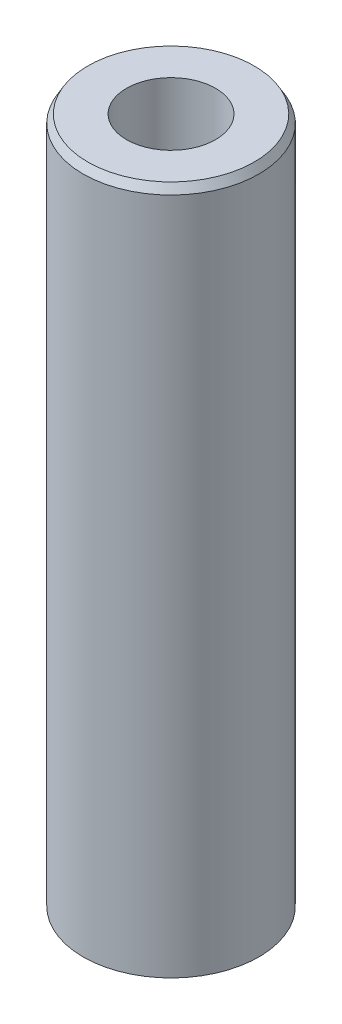
ISO-10303-21;
HEADER;
FILE_DESCRIPTION(('STEP AP214'),'2;1');
FILE_NAME('part.step','',(''),(''),'','','');
FILE_SCHEMA(('AUTOMOTIVE_DESIGN { 1 0 10303 214 1 1 1 1 }'));
ENDSEC;
DATA;
#1=APPLICATION_CONTEXT('core data for automotive mechanical design processes');
#2=APPLICATION_PROTOCOL_DEFINITION('international standard','automotive_design',2000,#1);
#3=PRODUCT_CONTEXT('',#1,'mechanical');
#4=PRODUCT('Part','Part','',(#3));
#5=PRODUCT_RELATED_PRODUCT_CATEGORY('part','',(#4));
#6=PRODUCT_DEFINITION_FORMATION('','',#4);
#7=PRODUCT_DEFINITION_CONTEXT('part definition',#1,'design');
#8=PRODUCT_DEFINITION('design','',#6,#7);
#9=PRODUCT_DEFINITION_SHAPE('','',#8);
#10=(LENGTH_UNIT() NAMED_UNIT(*) SI_UNIT(.MILLI.,.METRE.));
#11=(NAMED_UNIT(*) PLANE_ANGLE_UNIT() SI_UNIT($,.RADIAN.));
#12=(NAMED_UNIT(*) SI_UNIT($,.STERADIAN.) SOLID_ANGLE_UNIT());
#13=UNCERTAINTY_MEASURE_WITH_UNIT(LENGTH_MEASURE(1.E-05),#10,'distance_accuracy_value','');
#14=(GEOMETRIC_REPRESENTATION_CONTEXT(3) GLOBAL_UNCERTAINTY_ASSIGNED_CONTEXT((#13)) GLOBAL_UNIT_ASSIGNED_CONTEXT((#10,
#11,#12)) REPRESENTATION_CONTEXT('',''));
#15=CARTESIAN_POINT('',(0.,0.,0.));
#16=DIRECTION('',(0.,0.,1.));
#17=DIRECTION('',(1.,0.,0.));
#18=AXIS2_PLACEMENT_3D('',#15,#16,#17);
#19=CARTESIAN_POINT('',(0.,333.935593811543,0.));
#20=DIRECTION('',(0.,-1.,0.));
#21=DIRECTION('',(0.,0.,-1.));
#22=AXIS2_PLACEMENT_3D('',#19,#20,#21);
#23=CYLINDRICAL_SURFACE('',#22,42.5);
#24=CARTESIAN_POINT('',(0.,330.034716298217,0.));
#25=DIRECTION('',(0.,1.,0.));
#26=DIRECTION('',(0.,0.,1.));
#27=AXIS2_PLACEMENT_3D('',#24,#25,#26);
#28=CIRCLE('',#27,42.5);
#29=CARTESIAN_POINT('',(0.,330.034716298217,42.5));
#30=VERTEX_POINT('',#29);
#31=EDGE_CURVE('E50',#30,#30,#28,.F.);
#32=ORIENTED_EDGE('',*,*,#31,.T.);
#33=EDGE_LOOP('',(#32));
#34=FACE_BOUND('',#33,.T.);
#35=CARTESIAN_POINT('',(0.,2.25217268239403,0.));
#36=DIRECTION('',(0.,1.,0.));
#37=DIRECTION('',(0.,0.,1.));
#38=AXIS2_PLACEMENT_3D('',#35,#36,#37);
#39=CIRCLE('',#38,42.5);
#40=CARTESIAN_POINT('',(0.,2.25217268239403,42.5));
#41=VERTEX_POINT('',#40);
#42=EDGE_CURVE('E51',#41,#41,#39,.T.);
#43=ORIENTED_EDGE('',*,*,#42,.T.);
#44=EDGE_LOOP('',(#43));
#45=FACE_BOUND('',#44,.T.);
#46=ADVANCED_FACE('F39',(#34,#45),#23,.T.);
#47=CARTESIAN_POINT('',(0.,333.935593811543,0.));
#48=DIRECTION('',(0.,1.,0.));
#49=DIRECTION('',(0.,0.,1.));
#50=AXIS2_PLACEMENT_3D('',#47,#48,#49);
#51=PLANE('',#50);
#52=CARTESIAN_POINT('',(0.,333.935593811543,0.));
#53=DIRECTION('',(0.,1.,0.));
#54=DIRECTION('',(0.,0.,1.));
#55=AXIS2_PLACEMENT_3D('',#52,#53,#54);
#56=CIRCLE('',#55,40.2478273176059);
#57=CARTESIAN_POINT('',(0.,333.935593811543,40.2478273176059));
#58=VERTEX_POINT('',#57);
#59=EDGE_CURVE('E54',#58,#58,#56,.T.);
#60=ORIENTED_EDGE('',*,*,#59,.T.);
#61=EDGE_LOOP('',(#60));
#62=FACE_BOUND('',#61,.T.);
#63=CARTESIAN_POINT('',(0.,333.935593811543,0.));
#64=DIRECTION('',(0.,1.,0.));
#65=DIRECTION('',(0.,0.,1.));
#66=AXIS2_PLACEMENT_3D('',#63,#64,#65);
#67=CIRCLE('',#66,21.5270194667553);
#68=CARTESIAN_POINT('',(0.,333.935593811543,21.5270194667553));
#69=VERTEX_POINT('',#68);
#70=EDGE_CURVE('E58',#69,#69,#67,.T.);
#71=ORIENTED_EDGE('',*,*,#70,.F.);
#72=EDGE_LOOP('',(#71));
#73=FACE_BOUND('',#72,.T.);
#74=ADVANCED_FACE('F69',(#62,#73),#51,.T.);
#75=CARTESIAN_POINT('',(0.,0.,0.));
#76=DIRECTION('',(0.,1.,0.));
#77=DIRECTION('',(0.,0.,1.));
#78=AXIS2_PLACEMENT_3D('',#75,#76,#77);
#79=PLANE('',#78);
#80=CARTESIAN_POINT('',(0.,0.,0.));
#81=DIRECTION('',(0.,1.,0.));
#82=DIRECTION('',(0.,0.,1.));
#83=AXIS2_PLACEMENT_3D('',#80,#81,#82);
#84=CIRCLE('',#83,38.5991224866749);
#85=CARTESIAN_POINT('',(0.,0.,38.5991224866749));
#86=VERTEX_POINT('',#85);
#87=EDGE_CURVE('E10',#86,#86,#84,.F.);
#88=ORIENTED_EDGE('',*,*,#87,.T.);
#89=EDGE_LOOP('',(#88));
#90=FACE_BOUND('',#89,.T.);
#91=CARTESIAN_POINT('',(0.,0.,0.));
#92=DIRECTION('',(0.,1.,0.));
#93=DIRECTION('',(0.,0.,1.));
#94=AXIS2_PLACEMENT_3D('',#91,#92,#93);
#95=CIRCLE('',#94,21.5270194667553);
#96=CARTESIAN_POINT('',(0.,0.,21.5270194667553));
#97=VERTEX_POINT('',#96);
#98=EDGE_CURVE('E63',#97,#97,#95,.T.);
#99=ORIENTED_EDGE('',*,*,#98,.T.);
#100=EDGE_LOOP('',(#99));
#101=FACE_BOUND('',#100,.T.);
#102=ADVANCED_FACE('F75',(#90,#101),#79,.F.);
#103=CARTESIAN_POINT('',(0.,333.935593811543,0.));
#104=DIRECTION('',(0.,-1.,0.));
#105=DIRECTION('',(0.,0.,-1.));
#106=AXIS2_PLACEMENT_3D('',#103,#104,#105);
#107=CYLINDRICAL_SURFACE('',#106,21.5270194667553);
#108=ORIENTED_EDGE('',*,*,#70,.T.);
#109=EDGE_LOOP('',(#108));
#110=FACE_BOUND('',#109,.T.);
#111=ORIENTED_EDGE('',*,*,#98,.F.);
#112=EDGE_LOOP('',(#111));
#113=FACE_BOUND('',#112,.T.);
#114=ADVANCED_FACE('F70',(#110,#113),#107,.F.);
#115=CARTESIAN_POINT('',(0.,333.935593811543,0.));
#116=DIRECTION('',(0.,-1.,0.));
#117=DIRECTION('',(0.,0.,-1.));
#118=AXIS2_PLACEMENT_3D('',#115,#116,#117);
#119=CONICAL_SURFACE('',#118,40.2478273176059,0.523598775598292);
#120=ORIENTED_EDGE('',*,*,#31,.F.);
#121=EDGE_LOOP('',(#120));
#122=FACE_BOUND('',#121,.T.);
#123=ORIENTED_EDGE('',*,*,#59,.F.);
#124=EDGE_LOOP('',(#123));
#125=FACE_BOUND('',#124,.T.);
#126=ADVANCED_FACE('F81',(#122,#125),#119,.T.);
#127=CARTESIAN_POINT('',(0.,2.25217268239403,0.));
#128=DIRECTION('',(0.,1.,0.));
#129=DIRECTION('',(0.,0.,1.));
#130=AXIS2_PLACEMENT_3D('',#127,#128,#129);
#131=CONICAL_SURFACE('',#130,42.5,1.04719755119659);
#132=ORIENTED_EDGE('',*,*,#87,.F.);
#133=EDGE_LOOP('',(#132));
#134=FACE_BOUND('',#133,.T.);
#135=ORIENTED_EDGE('',*,*,#42,.F.);
#136=EDGE_LOOP('',(#135));
#137=FACE_BOUND('',#136,.T.);
#138=ADVANCED_FACE('F45',(#134,#137),#131,.T.);
#139=CLOSED_SHELL('',(#46,#74,#102,#114,#126,#138));
#140=MANIFOLD_SOLID_BREP('B2',#139);
#141=ADVANCED_BREP_SHAPE_REPRESENTATION('',(#18,#140),#14);
#142=SHAPE_DEFINITION_REPRESENTATION(#9,#141);
ENDSEC;
END-ISO-10303-21;
